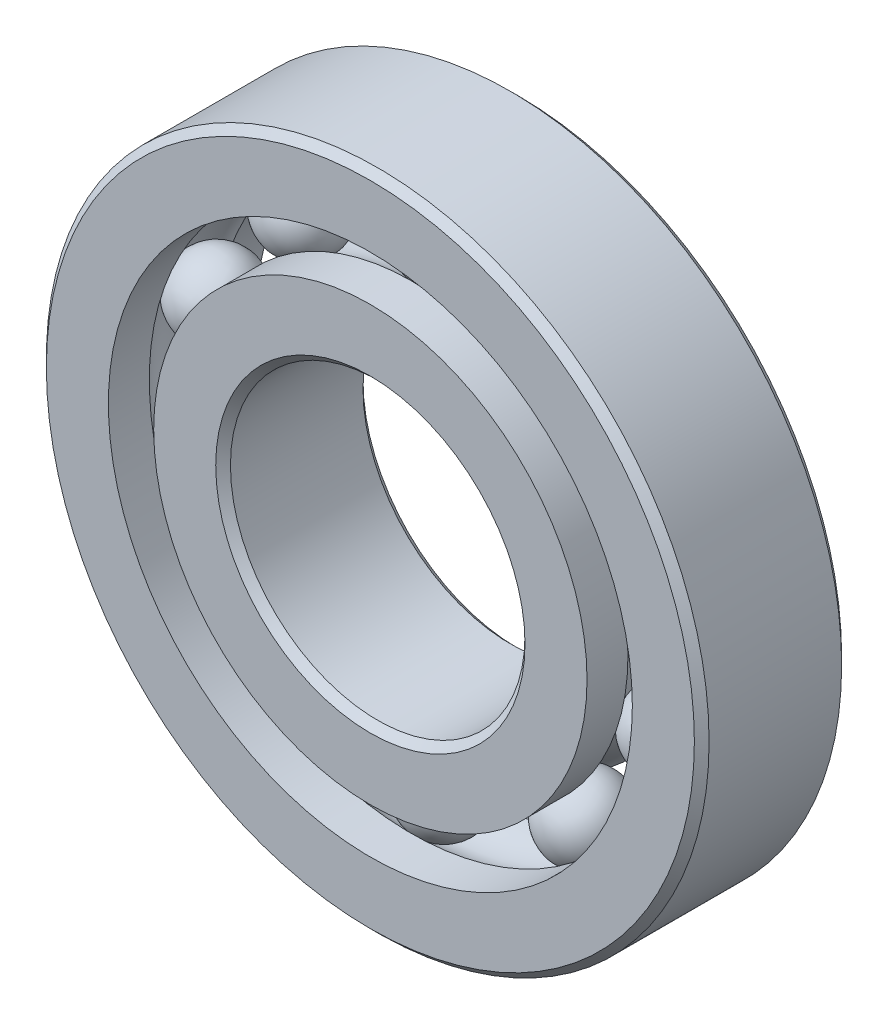
ISO-10303-21;
HEADER;
FILE_DESCRIPTION(('STEP AP214'),'2;1');
FILE_NAME('part.step','',(''),(''),'','','');
FILE_SCHEMA(('AUTOMOTIVE_DESIGN { 1 0 10303 214 1 1 1 1 }'));
ENDSEC;
DATA;
#1=APPLICATION_CONTEXT('core data for automotive mechanical design processes');
#2=APPLICATION_PROTOCOL_DEFINITION('international standard','automotive_design',2000,#1);
#3=PRODUCT_CONTEXT('',#1,'mechanical');
#4=PRODUCT('Part','Part','',(#3));
#5=PRODUCT_RELATED_PRODUCT_CATEGORY('part','',(#4));
#6=PRODUCT_DEFINITION_FORMATION('','',#4);
#7=PRODUCT_DEFINITION_CONTEXT('part definition',#1,'design');
#8=PRODUCT_DEFINITION('design','',#6,#7);
#9=PRODUCT_DEFINITION_SHAPE('','',#8);
#10=(LENGTH_UNIT() NAMED_UNIT(*) SI_UNIT(.MILLI.,.METRE.));
#11=(NAMED_UNIT(*) PLANE_ANGLE_UNIT() SI_UNIT($,.RADIAN.));
#12=(NAMED_UNIT(*) SI_UNIT($,.STERADIAN.) SOLID_ANGLE_UNIT());
#13=UNCERTAINTY_MEASURE_WITH_UNIT(LENGTH_MEASURE(1.E-05),#10,'distance_accuracy_value','');
#14=(GEOMETRIC_REPRESENTATION_CONTEXT(3) GLOBAL_UNCERTAINTY_ASSIGNED_CONTEXT((#13)) GLOBAL_UNIT_ASSIGNED_CONTEXT((#10,
#11,#12)) REPRESENTATION_CONTEXT('',''));
#15=CARTESIAN_POINT('',(0.,0.,0.));
#16=DIRECTION('',(0.,0.,1.));
#17=DIRECTION('',(1.,0.,0.));
#18=AXIS2_PLACEMENT_3D('',#15,#16,#17);
#19=CARTESIAN_POINT('',(-6.06520907209285,8.34804411070657,0.));
#20=DIRECTION('',(0.,0.,1.));
#21=DIRECTION('',(-0.587785252292462,0.809016994374955,0.));
#22=AXIS2_PLACEMENT_3D('',#19,#20,#21);
#23=SPHERICAL_SURFACE('',#22,1.71627890103156);
#24=CARTESIAN_POINT('',(-6.06520907209285,8.34804411070657,1.71627890103156));
#25=VERTEX_POINT('',#24);
#26=VERTEX_LOOP('',#25);
#27=FACE_BOUND('',#26,.T.);
#28=ADVANCED_FACE('F39',(#27),#23,.T.);
#29=CLOSED_SHELL('',(#28));
#30=MANIFOLD_SOLID_BREP('B2',#29);
#31=CARTESIAN_POINT('',(-9.81371442752058,3.1886691107066,0.));
#32=DIRECTION('',(0.,0.,1.));
#33=DIRECTION('',(-0.95105651629515,0.309016994374958,0.));
#34=AXIS2_PLACEMENT_3D('',#31,#32,#33);
#35=SPHERICAL_SURFACE('',#34,1.71627890103156);
#36=CARTESIAN_POINT('',(-9.81371442752058,3.1886691107066,1.71627890103156));
#37=VERTEX_POINT('',#36);
#38=VERTEX_LOOP('',#37);
#39=FACE_BOUND('',#38,.T.);
#40=ADVANCED_FACE('F59',(#39),#35,.T.);
#41=CLOSED_SHELL('',(#40));
#42=MANIFOLD_SOLID_BREP('B6',#41);
#43=CARTESIAN_POINT('',(-9.81371442752065,-3.18866911070639,0.));
#44=DIRECTION('',(0.,0.,1.));
#45=DIRECTION('',(-0.951056516295157,-0.309016994374938,0.));
#46=AXIS2_PLACEMENT_3D('',#43,#44,#45);
#47=SPHERICAL_SURFACE('',#46,1.71627890103156);
#48=CARTESIAN_POINT('',(-9.81371442752065,-3.18866911070639,1.71627890103156));
#49=VERTEX_POINT('',#48);
#50=VERTEX_LOOP('',#49);
#51=FACE_BOUND('',#50,.T.);
#52=ADVANCED_FACE('F79',(#51),#47,.T.);
#53=CLOSED_SHELL('',(#52));
#54=MANIFOLD_SOLID_BREP('B35',#53);
#55=CARTESIAN_POINT('',(-6.06520907209303,-8.34804411070644,0.));
#56=DIRECTION('',(0.,0.,1.));
#57=DIRECTION('',(-0.58778525229248,-0.809016994374942,0.));
#58=AXIS2_PLACEMENT_3D('',#55,#56,#57);
#59=SPHERICAL_SURFACE('',#58,1.71627890103156);
#60=CARTESIAN_POINT('',(-6.06520907209303,-8.34804411070644,1.71627890103156));
#61=VERTEX_POINT('',#60);
#62=VERTEX_LOOP('',#61);
#63=FACE_BOUND('',#62,.T.);
#64=ADVANCED_FACE('F99',(#63),#59,.T.);
#65=CLOSED_SHELL('',(#64));
#66=MANIFOLD_SOLID_BREP('B55',#65);
#67=CARTESIAN_POINT('',(0.,-10.31875,0.));
#68=DIRECTION('',(0.,0.,1.));
#69=DIRECTION('',(0.,-1.,0.));
#70=AXIS2_PLACEMENT_3D('',#67,#68,#69);
#71=SPHERICAL_SURFACE('',#70,1.71627890103156);
#72=CARTESIAN_POINT('',(0.,-10.31875,1.71627890103156));
#73=VERTEX_POINT('',#72);
#74=VERTEX_LOOP('',#73);
#75=FACE_BOUND('',#74,.T.);
#76=ADVANCED_FACE('F119',(#75),#71,.T.);
#77=CLOSED_SHELL('',(#76));
#78=MANIFOLD_SOLID_BREP('B75',#77);
#79=CARTESIAN_POINT('',(6.06520907209291,-8.34804411070652,0.));
#80=DIRECTION('',(0.,0.,1.));
#81=DIRECTION('',(0.587785252292469,-0.809016994374951,0.));
#82=AXIS2_PLACEMENT_3D('',#79,#80,#81);
#83=SPHERICAL_SURFACE('',#82,1.71627890103156);
#84=CARTESIAN_POINT('',(6.06520907209291,-8.34804411070652,1.71627890103156));
#85=VERTEX_POINT('',#84);
#86=VERTEX_LOOP('',#85);
#87=FACE_BOUND('',#86,.T.);
#88=ADVANCED_FACE('F139',(#87),#83,.T.);
#89=CLOSED_SHELL('',(#88));
#90=MANIFOLD_SOLID_BREP('B95',#89);
#91=CARTESIAN_POINT('',(9.8137144275206,-3.18866911070653,0.));
#92=DIRECTION('',(0.,0.,1.));
#93=DIRECTION('',(0.951056516295152,-0.309016994374952,0.));
#94=AXIS2_PLACEMENT_3D('',#91,#92,#93);
#95=SPHERICAL_SURFACE('',#94,1.71627890103156);
#96=CARTESIAN_POINT('',(9.8137144275206,-3.18866911070653,1.71627890103156));
#97=VERTEX_POINT('',#96);
#98=VERTEX_LOOP('',#97);
#99=FACE_BOUND('',#98,.T.);
#100=ADVANCED_FACE('F159',(#99),#95,.T.);
#101=CLOSED_SHELL('',(#100));
#102=MANIFOLD_SOLID_BREP('B115',#101);
#103=CARTESIAN_POINT('',(9.81371442752063,3.18866911070646,0.));
#104=DIRECTION('',(0.,0.,1.));
#105=DIRECTION('',(0.951056516295155,0.309016994374945,0.));
#106=AXIS2_PLACEMENT_3D('',#103,#104,#105);
#107=SPHERICAL_SURFACE('',#106,1.71627890103156);
#108=CARTESIAN_POINT('',(9.81371442752063,3.18866911070646,1.71627890103156));
#109=VERTEX_POINT('',#108);
#110=VERTEX_LOOP('',#109);
#111=FACE_BOUND('',#110,.T.);
#112=ADVANCED_FACE('F179',(#111),#107,.T.);
#113=CLOSED_SHELL('',(#112));
#114=MANIFOLD_SOLID_BREP('B135',#113);
#115=CARTESIAN_POINT('',(6.06520907209297,8.34804411070648,0.));
#116=DIRECTION('',(0.,0.,1.));
#117=DIRECTION('',(0.587785252292474,0.809016994374947,0.));
#118=AXIS2_PLACEMENT_3D('',#115,#116,#117);
#119=SPHERICAL_SURFACE('',#118,1.71627890103156);
#120=CARTESIAN_POINT('',(6.06520907209297,8.34804411070648,1.71627890103156));
#121=VERTEX_POINT('',#120);
#122=VERTEX_LOOP('',#121);
#123=FACE_BOUND('',#122,.T.);
#124=ADVANCED_FACE('F199',(#123),#119,.T.);
#125=CLOSED_SHELL('',(#124));
#126=MANIFOLD_SOLID_BREP('B155',#125);
#127=CARTESIAN_POINT('',(0.,10.31875,0.));
#128=DIRECTION('',(0.,0.,1.));
#129=DIRECTION('',(0.,1.,0.));
#130=AXIS2_PLACEMENT_3D('',#127,#128,#129);
#131=SPHERICAL_SURFACE('',#130,1.71627890103156);
#132=CARTESIAN_POINT('',(0.,10.31875,1.71627890103156));
#133=VERTEX_POINT('',#132);
#134=VERTEX_LOOP('',#133);
#135=FACE_BOUND('',#134,.T.);
#136=ADVANCED_FACE('F221',(#135),#131,.T.);
#137=CLOSED_SHELL('',(#136));
#138=MANIFOLD_SOLID_BREP('B175',#137);
#139=CARTESIAN_POINT('',(0.,9.34182692307692,3.175));
#140=DIRECTION('',(0.,0.,-1.));
#141=DIRECTION('',(-1.,0.,0.));
#142=AXIS2_PLACEMENT_3D('',#139,#140,#141);
#143=PLANE('',#142);
#144=CARTESIAN_POINT('',(0.,0.,3.175));
#145=DIRECTION('',(0.,0.,1.));
#146=DIRECTION('',(1.,0.,0.));
#147=AXIS2_PLACEMENT_3D('',#144,#145,#146);
#148=CIRCLE('',#147,6.6675);
#149=CARTESIAN_POINT('',(6.6675,0.,3.175));
#150=VERTEX_POINT('',#149);
#151=EDGE_CURVE('E268',#150,#150,#148,.T.);
#152=ORIENTED_EDGE('',*,*,#151,.F.);
#153=EDGE_LOOP('',(#152));
#154=FACE_BOUND('',#153,.T.);
#155=CARTESIAN_POINT('',(0.,0.,3.175));
#156=DIRECTION('',(0.,0.,1.));
#157=DIRECTION('',(1.,0.,0.));
#158=AXIS2_PLACEMENT_3D('',#155,#156,#157);
#159=CIRCLE('',#158,9.34182692307692);
#160=CARTESIAN_POINT('',(9.34182692307692,0.,3.175));
#161=VERTEX_POINT('',#160);
#162=EDGE_CURVE('E220',#161,#161,#159,.T.);
#163=ORIENTED_EDGE('',*,*,#162,.T.);
#164=EDGE_LOOP('',(#163));
#165=FACE_BOUND('',#164,.T.);
#166=ADVANCED_FACE('F240',(#154,#165),#143,.F.);
#167=CARTESIAN_POINT('',(0.,0.,3.175));
#168=DIRECTION('',(0.,0.,1.));
#169=DIRECTION('',(1.,0.,0.));
#170=AXIS2_PLACEMENT_3D('',#167,#168,#169);
#171=CYLINDRICAL_SURFACE('',#170,9.34182692307692);
#172=ORIENTED_EDGE('',*,*,#162,.F.);
#173=EDGE_LOOP('',(#172));
#174=FACE_BOUND('',#173,.T.);
#175=CARTESIAN_POINT('',(0.,0.,1.41111111111111));
#176=DIRECTION('',(0.,0.,1.));
#177=DIRECTION('',(1.,0.,0.));
#178=AXIS2_PLACEMENT_3D('',#175,#176,#177);
#179=CIRCLE('',#178,9.34182692307692);
#180=CARTESIAN_POINT('',(9.34182692307692,0.,1.41111111111111));
#181=VERTEX_POINT('',#180);
#182=EDGE_CURVE('E246',#181,#181,#179,.T.);
#183=ORIENTED_EDGE('',*,*,#182,.T.);
#184=EDGE_LOOP('',(#183));
#185=FACE_BOUND('',#184,.T.);
#186=ADVANCED_FACE('F275',(#174,#185),#171,.T.);
#187=CARTESIAN_POINT('',(0.,0.,0.));
#188=DIRECTION('',(0.,0.,1.));
#189=DIRECTION('',(1.,0.,0.));
#190=AXIS2_PLACEMENT_3D('',#187,#188,#189);
#191=TOROIDAL_SURFACE('',#190,10.31875,1.71627890103155);
#192=ORIENTED_EDGE('',*,*,#182,.F.);
#193=EDGE_LOOP('',(#192));
#194=FACE_BOUND('',#193,.T.);
#195=CARTESIAN_POINT('',(0.,0.,-1.41111111111111));
#196=DIRECTION('',(0.,0.,1.));
#197=DIRECTION('',(1.,0.,0.));
#198=AXIS2_PLACEMENT_3D('',#195,#196,#197);
#199=CIRCLE('',#198,9.34182692307692);
#200=CARTESIAN_POINT('',(9.34182692307692,0.,-1.41111111111111));
#201=VERTEX_POINT('',#200);
#202=EDGE_CURVE('E250',#201,#201,#199,.T.);
#203=ORIENTED_EDGE('',*,*,#202,.T.);
#204=EDGE_LOOP('',(#203));
#205=FACE_BOUND('',#204,.T.);
#206=ADVANCED_FACE('F279',(#194,#205),#191,.F.);
#207=CARTESIAN_POINT('',(0.,0.,3.175));
#208=DIRECTION('',(0.,0.,1.));
#209=DIRECTION('',(1.,0.,0.));
#210=AXIS2_PLACEMENT_3D('',#207,#208,#209);
#211=CYLINDRICAL_SURFACE('',#210,9.34182692307692);
#212=ORIENTED_EDGE('',*,*,#202,.F.);
#213=EDGE_LOOP('',(#212));
#214=FACE_BOUND('',#213,.T.);
#215=CARTESIAN_POINT('',(0.,0.,-3.175));
#216=DIRECTION('',(0.,0.,1.));
#217=DIRECTION('',(1.,0.,0.));
#218=AXIS2_PLACEMENT_3D('',#215,#216,#217);
#219=CIRCLE('',#218,9.34182692307692);
#220=CARTESIAN_POINT('',(9.34182692307692,0.,-3.175));
#221=VERTEX_POINT('',#220);
#222=EDGE_CURVE('E254',#221,#221,#219,.T.);
#223=ORIENTED_EDGE('',*,*,#222,.T.);
#224=EDGE_LOOP('',(#223));
#225=FACE_BOUND('',#224,.T.);
#226=ADVANCED_FACE('F284',(#214,#225),#211,.T.);
#227=CARTESIAN_POINT('',(0.,6.6675,-3.175));
#228=DIRECTION('',(0.,0.,1.));
#229=DIRECTION('',(1.,0.,0.));
#230=AXIS2_PLACEMENT_3D('',#227,#228,#229);
#231=PLANE('',#230);
#232=ORIENTED_EDGE('',*,*,#222,.F.);
#233=EDGE_LOOP('',(#232));
#234=FACE_BOUND('',#233,.T.);
#235=CARTESIAN_POINT('',(0.,0.,-3.175));
#236=DIRECTION('',(0.,0.,1.));
#237=DIRECTION('',(1.,0.,0.));
#238=AXIS2_PLACEMENT_3D('',#235,#236,#237);
#239=CIRCLE('',#238,6.6675);
#240=CARTESIAN_POINT('',(6.6675,0.,-3.175));
#241=VERTEX_POINT('',#240);
#242=EDGE_CURVE('E259',#241,#241,#239,.T.);
#243=ORIENTED_EDGE('',*,*,#242,.T.);
#244=EDGE_LOOP('',(#243));
#245=FACE_BOUND('',#244,.T.);
#246=ADVANCED_FACE('F290',(#234,#245),#231,.F.);
#247=CARTESIAN_POINT('',(0.,0.,-2.8575));
#248=DIRECTION('',(0.,0.,-1.));
#249=DIRECTION('',(-1.,0.,0.));
#250=AXIS2_PLACEMENT_3D('',#247,#248,#249);
#251=CONICAL_SURFACE('',#250,6.35,0.785398163397447);
#252=ORIENTED_EDGE('',*,*,#242,.F.);
#253=EDGE_LOOP('',(#252));
#254=FACE_BOUND('',#253,.T.);
#255=CARTESIAN_POINT('',(0.,0.,-2.8575));
#256=DIRECTION('',(0.,0.,1.));
#257=DIRECTION('',(1.,0.,0.));
#258=AXIS2_PLACEMENT_3D('',#255,#256,#257);
#259=CIRCLE('',#258,6.35);
#260=CARTESIAN_POINT('',(6.35,0.,-2.8575));
#261=VERTEX_POINT('',#260);
#262=EDGE_CURVE('E262',#261,#261,#259,.T.);
#263=ORIENTED_EDGE('',*,*,#262,.T.);
#264=EDGE_LOOP('',(#263));
#265=FACE_BOUND('',#264,.T.);
#266=ADVANCED_FACE('F294',(#254,#265),#251,.F.);
#267=CARTESIAN_POINT('',(0.,0.,3.175));
#268=DIRECTION('',(0.,0.,1.));
#269=DIRECTION('',(1.,0.,0.));
#270=AXIS2_PLACEMENT_3D('',#267,#268,#269);
#271=CYLINDRICAL_SURFACE('',#270,6.35);
#272=ORIENTED_EDGE('',*,*,#262,.F.);
#273=EDGE_LOOP('',(#272));
#274=FACE_BOUND('',#273,.T.);
#275=CARTESIAN_POINT('',(0.,0.,2.8575));
#276=DIRECTION('',(0.,0.,1.));
#277=DIRECTION('',(1.,0.,0.));
#278=AXIS2_PLACEMENT_3D('',#275,#276,#277);
#279=CIRCLE('',#278,6.35);
#280=CARTESIAN_POINT('',(6.35,0.,2.8575));
#281=VERTEX_POINT('',#280);
#282=EDGE_CURVE('E265',#281,#281,#279,.T.);
#283=ORIENTED_EDGE('',*,*,#282,.T.);
#284=EDGE_LOOP('',(#283));
#285=FACE_BOUND('',#284,.T.);
#286=ADVANCED_FACE('F298',(#274,#285),#271,.F.);
#287=CARTESIAN_POINT('',(0.,0.,3.175));
#288=DIRECTION('',(0.,0.,1.));
#289=DIRECTION('',(1.,0.,0.));
#290=AXIS2_PLACEMENT_3D('',#287,#288,#289);
#291=CONICAL_SURFACE('',#290,6.6675,0.785398163397452);
#292=ORIENTED_EDGE('',*,*,#282,.F.);
#293=EDGE_LOOP('',(#292));
#294=FACE_BOUND('',#293,.T.);
#295=ORIENTED_EDGE('',*,*,#151,.T.);
#296=EDGE_LOOP('',(#295));
#297=FACE_BOUND('',#296,.T.);
#298=ADVANCED_FACE('F272',(#294,#297),#291,.F.);
#299=CLOSED_SHELL('',(#166,#186,#206,#226,#246,#266,#286,#298));
#300=MANIFOLD_SOLID_BREP('B195',#299);
#301=CARTESIAN_POINT('',(0.,0.,2.8575));
#302=DIRECTION('',(0.,0.,-1.));
#303=DIRECTION('',(-1.,0.,0.));
#304=AXIS2_PLACEMENT_3D('',#301,#302,#303);
#305=CONICAL_SURFACE('',#304,14.2875,0.785398163397448);
#306=CARTESIAN_POINT('',(0.,0.,3.175));
#307=DIRECTION('',(0.,0.,1.));
#308=DIRECTION('',(1.,0.,0.));
#309=AXIS2_PLACEMENT_3D('',#306,#307,#308);
#310=CIRCLE('',#309,13.97);
#311=CARTESIAN_POINT('',(13.97,0.,3.175));
#312=VERTEX_POINT('',#311);
#313=EDGE_CURVE('E389',#312,#312,#310,.T.);
#314=ORIENTED_EDGE('',*,*,#313,.F.);
#315=EDGE_LOOP('',(#314));
#316=FACE_BOUND('',#315,.T.);
#317=CARTESIAN_POINT('',(0.,0.,2.8575));
#318=DIRECTION('',(0.,0.,1.));
#319=DIRECTION('',(1.,0.,0.));
#320=AXIS2_PLACEMENT_3D('',#317,#318,#319);
#321=CIRCLE('',#320,14.2875);
#322=CARTESIAN_POINT('',(14.2875,0.,2.8575));
#323=VERTEX_POINT('',#322);
#324=EDGE_CURVE('E239',#323,#323,#321,.T.);
#325=ORIENTED_EDGE('',*,*,#324,.T.);
#326=EDGE_LOOP('',(#325));
#327=FACE_BOUND('',#326,.T.);
#328=ADVANCED_FACE('F361',(#316,#327),#305,.T.);
#329=CARTESIAN_POINT('',(0.,0.,3.175));
#330=DIRECTION('',(0.,0.,1.));
#331=DIRECTION('',(1.,0.,0.));
#332=AXIS2_PLACEMENT_3D('',#329,#330,#331);
#333=CYLINDRICAL_SURFACE('',#332,14.2875);
#334=ORIENTED_EDGE('',*,*,#324,.F.);
#335=EDGE_LOOP('',(#334));
#336=FACE_BOUND('',#335,.T.);
#337=CARTESIAN_POINT('',(0.,0.,-2.8575));
#338=DIRECTION('',(0.,0.,1.));
#339=DIRECTION('',(1.,0.,0.));
#340=AXIS2_PLACEMENT_3D('',#337,#338,#339);
#341=CIRCLE('',#340,14.2875);
#342=CARTESIAN_POINT('',(14.2875,0.,-2.8575));
#343=VERTEX_POINT('',#342);
#344=EDGE_CURVE('E367',#343,#343,#341,.T.);
#345=ORIENTED_EDGE('',*,*,#344,.T.);
#346=EDGE_LOOP('',(#345));
#347=FACE_BOUND('',#346,.T.);
#348=ADVANCED_FACE('F396',(#336,#347),#333,.T.);
#349=CARTESIAN_POINT('',(0.,0.,-3.175));
#350=DIRECTION('',(0.,0.,1.));
#351=DIRECTION('',(1.,0.,0.));
#352=AXIS2_PLACEMENT_3D('',#349,#350,#351);
#353=CONICAL_SURFACE('',#352,13.97,0.785398163397447);
#354=ORIENTED_EDGE('',*,*,#344,.F.);
#355=EDGE_LOOP('',(#354));
#356=FACE_BOUND('',#355,.T.);
#357=CARTESIAN_POINT('',(0.,0.,-3.175));
#358=DIRECTION('',(0.,0.,1.));
#359=DIRECTION('',(1.,0.,0.));
#360=AXIS2_PLACEMENT_3D('',#357,#358,#359);
#361=CIRCLE('',#360,13.97);
#362=CARTESIAN_POINT('',(13.97,0.,-3.175));
#363=VERTEX_POINT('',#362);
#364=EDGE_CURVE('E371',#363,#363,#361,.T.);
#365=ORIENTED_EDGE('',*,*,#364,.T.);
#366=EDGE_LOOP('',(#365));
#367=FACE_BOUND('',#366,.T.);
#368=ADVANCED_FACE('F400',(#356,#367),#353,.T.);
#369=CARTESIAN_POINT('',(0.,13.97,-3.175));
#370=DIRECTION('',(0.,0.,1.));
#371=DIRECTION('',(1.,0.,0.));
#372=AXIS2_PLACEMENT_3D('',#369,#370,#371);
#373=PLANE('',#372);
#374=ORIENTED_EDGE('',*,*,#364,.F.);
#375=EDGE_LOOP('',(#374));
#376=FACE_BOUND('',#375,.T.);
#377=CARTESIAN_POINT('',(0.,0.,-3.175));
#378=DIRECTION('',(0.,0.,1.));
#379=DIRECTION('',(1.,0.,0.));
#380=AXIS2_PLACEMENT_3D('',#377,#378,#379);
#381=CIRCLE('',#380,11.2956730769231);
#382=CARTESIAN_POINT('',(11.2956730769231,0.,-3.175));
#383=VERTEX_POINT('',#382);
#384=EDGE_CURVE('E375',#383,#383,#381,.T.);
#385=ORIENTED_EDGE('',*,*,#384,.T.);
#386=EDGE_LOOP('',(#385));
#387=FACE_BOUND('',#386,.T.);
#388=ADVANCED_FACE('F405',(#376,#387),#373,.F.);
#389=CARTESIAN_POINT('',(0.,0.,3.175));
#390=DIRECTION('',(0.,0.,1.));
#391=DIRECTION('',(1.,0.,0.));
#392=AXIS2_PLACEMENT_3D('',#389,#390,#391);
#393=CYLINDRICAL_SURFACE('',#392,11.2956730769231);
#394=ORIENTED_EDGE('',*,*,#384,.F.);
#395=EDGE_LOOP('',(#394));
#396=FACE_BOUND('',#395,.T.);
#397=CARTESIAN_POINT('',(0.,0.,-1.41111111111111));
#398=DIRECTION('',(0.,0.,1.));
#399=DIRECTION('',(1.,0.,0.));
#400=AXIS2_PLACEMENT_3D('',#397,#398,#399);
#401=CIRCLE('',#400,11.2956730769231);
#402=CARTESIAN_POINT('',(11.2956730769231,0.,-1.41111111111111));
#403=VERTEX_POINT('',#402);
#404=EDGE_CURVE('E380',#403,#403,#401,.T.);
#405=ORIENTED_EDGE('',*,*,#404,.T.);
#406=EDGE_LOOP('',(#405));
#407=FACE_BOUND('',#406,.T.);
#408=ADVANCED_FACE('F411',(#396,#407),#393,.F.);
#409=CARTESIAN_POINT('',(0.,0.,0.));
#410=DIRECTION('',(0.,0.,1.));
#411=DIRECTION('',(1.,0.,0.));
#412=AXIS2_PLACEMENT_3D('',#409,#410,#411);
#413=TOROIDAL_SURFACE('',#412,10.31875,1.71627890103156);
#414=ORIENTED_EDGE('',*,*,#404,.F.);
#415=EDGE_LOOP('',(#414));
#416=FACE_BOUND('',#415,.T.);
#417=CARTESIAN_POINT('',(0.,0.,1.41111111111111));
#418=DIRECTION('',(0.,0.,1.));
#419=DIRECTION('',(1.,0.,0.));
#420=AXIS2_PLACEMENT_3D('',#417,#418,#419);
#421=CIRCLE('',#420,11.2956730769231);
#422=CARTESIAN_POINT('',(11.2956730769231,0.,1.41111111111111));
#423=VERTEX_POINT('',#422);
#424=EDGE_CURVE('E383',#423,#423,#421,.T.);
#425=ORIENTED_EDGE('',*,*,#424,.T.);
#426=EDGE_LOOP('',(#425));
#427=FACE_BOUND('',#426,.T.);
#428=ADVANCED_FACE('F415',(#416,#427),#413,.F.);
#429=CARTESIAN_POINT('',(0.,0.,3.175));
#430=DIRECTION('',(0.,0.,1.));
#431=DIRECTION('',(1.,0.,0.));
#432=AXIS2_PLACEMENT_3D('',#429,#430,#431);
#433=CYLINDRICAL_SURFACE('',#432,11.2956730769231);
#434=ORIENTED_EDGE('',*,*,#424,.F.);
#435=EDGE_LOOP('',(#434));
#436=FACE_BOUND('',#435,.T.);
#437=CARTESIAN_POINT('',(0.,0.,3.175));
#438=DIRECTION('',(0.,0.,1.));
#439=DIRECTION('',(1.,0.,0.));
#440=AXIS2_PLACEMENT_3D('',#437,#438,#439);
#441=CIRCLE('',#440,11.2956730769231);
#442=CARTESIAN_POINT('',(11.2956730769231,0.,3.175));
#443=VERTEX_POINT('',#442);
#444=EDGE_CURVE('E386',#443,#443,#441,.T.);
#445=ORIENTED_EDGE('',*,*,#444,.T.);
#446=EDGE_LOOP('',(#445));
#447=FACE_BOUND('',#446,.T.);
#448=ADVANCED_FACE('F419',(#436,#447),#433,.F.);
#449=CARTESIAN_POINT('',(0.,13.97,3.175));
#450=DIRECTION('',(0.,0.,-1.));
#451=DIRECTION('',(-1.,0.,0.));
#452=AXIS2_PLACEMENT_3D('',#449,#450,#451);
#453=PLANE('',#452);
#454=ORIENTED_EDGE('',*,*,#444,.F.);
#455=EDGE_LOOP('',(#454));
#456=FACE_BOUND('',#455,.T.);
#457=ORIENTED_EDGE('',*,*,#313,.T.);
#458=EDGE_LOOP('',(#457));
#459=FACE_BOUND('',#458,.T.);
#460=ADVANCED_FACE('F393',(#456,#459),#453,.F.);
#461=CLOSED_SHELL('',(#328,#348,#368,#388,#408,#428,#448,#460));
#462=MANIFOLD_SOLID_BREP('B215',#461);
#463=ADVANCED_BREP_SHAPE_REPRESENTATION('',(#18,#30,#42,#54,#66,#78,#90,#102,#114,#126,#138,
#300,#462),#14);
#464=SHAPE_DEFINITION_REPRESENTATION(#9,#463);
ENDSEC;
END-ISO-10303-21;
